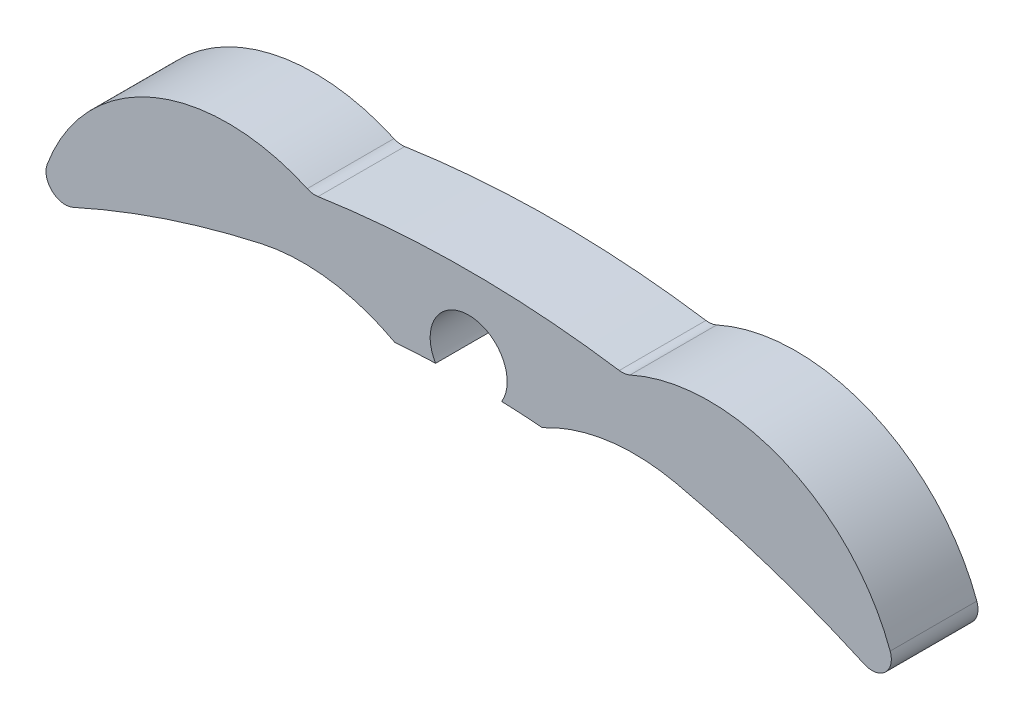
ISO-10303-21;
HEADER;
FILE_DESCRIPTION(('STEP AP214'),'2;1');
FILE_NAME('part.step','',(''),(''),'','','');
FILE_SCHEMA(('AUTOMOTIVE_DESIGN { 1 0 10303 214 1 1 1 1 }'));
ENDSEC;
DATA;
#1=APPLICATION_CONTEXT('core data for automotive mechanical design processes');
#2=APPLICATION_PROTOCOL_DEFINITION('international standard','automotive_design',2000,#1);
#3=PRODUCT_CONTEXT('',#1,'mechanical');
#4=PRODUCT('Part','Part','',(#3));
#5=PRODUCT_RELATED_PRODUCT_CATEGORY('part','',(#4));
#6=PRODUCT_DEFINITION_FORMATION('','',#4);
#7=PRODUCT_DEFINITION_CONTEXT('part definition',#1,'design');
#8=PRODUCT_DEFINITION('design','',#6,#7);
#9=PRODUCT_DEFINITION_SHAPE('','',#8);
#10=(LENGTH_UNIT() NAMED_UNIT(*) SI_UNIT(.MILLI.,.METRE.));
#11=(NAMED_UNIT(*) PLANE_ANGLE_UNIT() SI_UNIT($,.RADIAN.));
#12=(NAMED_UNIT(*) SI_UNIT($,.STERADIAN.) SOLID_ANGLE_UNIT());
#13=UNCERTAINTY_MEASURE_WITH_UNIT(LENGTH_MEASURE(1.E-05),#10,'distance_accuracy_value','');
#14=(GEOMETRIC_REPRESENTATION_CONTEXT(3) GLOBAL_UNCERTAINTY_ASSIGNED_CONTEXT((#13)) GLOBAL_UNIT_ASSIGNED_CONTEXT((#10,
#11,#12)) REPRESENTATION_CONTEXT('',''));
#15=CARTESIAN_POINT('',(0.,0.,0.));
#16=DIRECTION('',(0.,0.,1.));
#17=DIRECTION('',(1.,0.,0.));
#18=AXIS2_PLACEMENT_3D('',#15,#16,#17);
#19=CARTESIAN_POINT('',(0.,-48.845,4.5));
#20=DIRECTION('',(0.,0.,-1.));
#21=DIRECTION('',(-1.,0.,0.));
#22=AXIS2_PLACEMENT_3D('',#19,#20,#21);
#23=CYLINDRICAL_SURFACE('',#22,47.8476983184575);
#24=CARTESIAN_POINT('',(0.,-48.845,0.));
#25=DIRECTION('',(0.,0.,-1.));
#26=DIRECTION('',(1.,0.,0.));
#27=AXIS2_PLACEMENT_3D('',#24,#25,#26);
#28=CIRCLE('',#27,47.8476983184575);
#29=CARTESIAN_POINT('',(1.7155406767965,-1.02806623631773,0.));
#30=VERTEX_POINT('',#29);
#31=CARTESIAN_POINT('',(3.83085114312133,-1.15090378366136,0.));
#32=VERTEX_POINT('',#31);
#33=EDGE_CURVE('E153',#30,#32,#28,.T.);
#34=ORIENTED_EDGE('',*,*,#33,.T.);
#35=DIRECTION('',(0.,0.,1.));
#36=VECTOR('',#35,1.);
#37=CARTESIAN_POINT('',(3.83085114312133,-1.15090378366136,2.25));
#38=LINE('',#37,#36);
#39=CARTESIAN_POINT('',(3.83085114312133,-1.15090378366136,4.5));
#40=VERTEX_POINT('',#39);
#41=EDGE_CURVE('E140',#32,#40,#38,.T.);
#42=ORIENTED_EDGE('',*,*,#41,.T.);
#43=CARTESIAN_POINT('',(0.,-48.845,4.5));
#44=DIRECTION('',(0.,0.,-1.));
#45=DIRECTION('',(1.,0.,0.));
#46=AXIS2_PLACEMENT_3D('',#43,#44,#45);
#47=CIRCLE('',#46,47.8476983184575);
#48=CARTESIAN_POINT('',(1.7155406767965,-1.02806623631773,4.5));
#49=VERTEX_POINT('',#48);
#50=EDGE_CURVE('E151',#49,#40,#47,.T.);
#51=ORIENTED_EDGE('',*,*,#50,.F.);
#52=DIRECTION('',(0.,0.,-1.));
#53=VECTOR('',#52,1.);
#54=CARTESIAN_POINT('',(1.7155406767965,-1.02806623631773,4.5));
#55=LINE('',#54,#53);
#56=EDGE_CURVE('E177',#49,#30,#55,.T.);
#57=ORIENTED_EDGE('',*,*,#56,.T.);
#58=EDGE_LOOP('',(#34,#42,#51,#57));
#59=FACE_BOUND('',#58,.T.);
#60=ADVANCED_FACE('F33',(#59),#23,.F.);
#61=CARTESIAN_POINT('',(12.5,-5.61595883552355,4.5));
#62=DIRECTION('',(0.,0.,-1.));
#63=DIRECTION('',(-1.,0.,0.));
#64=AXIS2_PLACEMENT_3D('',#61,#62,#63);
#65=CYLINDRICAL_SURFACE('',#64,10.);
#66=CARTESIAN_POINT('',(12.5,-5.61595883552355,0.));
#67=DIRECTION('',(0.,0.,1.));
#68=DIRECTION('',(1.,0.,0.));
#69=AXIS2_PLACEMENT_3D('',#66,#67,#68);
#70=CIRCLE('',#69,10.);
#71=CARTESIAN_POINT('',(21.8868168597631,-2.16810889080908,0.));
#72=VERTEX_POINT('',#71);
#73=CARTESIAN_POINT('',(8.38018067722006,3.49596131050765,0.));
#74=VERTEX_POINT('',#73);
#75=EDGE_CURVE('E179',#72,#74,#70,.T.);
#76=ORIENTED_EDGE('',*,*,#75,.T.);
#77=DIRECTION('',(0.,0.,-1.));
#78=VECTOR('',#77,1.);
#79=CARTESIAN_POINT('',(8.38018067722006,3.49596131050765,4.5));
#80=LINE('',#79,#78);
#81=CARTESIAN_POINT('',(8.38018067722006,3.49596131050765,4.5));
#82=VERTEX_POINT('',#81);
#83=EDGE_CURVE('E211',#74,#82,#80,.F.);
#84=ORIENTED_EDGE('',*,*,#83,.T.);
#85=CARTESIAN_POINT('',(12.5,-5.61595883552355,4.5));
#86=DIRECTION('',(0.,0.,1.));
#87=DIRECTION('',(1.,0.,0.));
#88=AXIS2_PLACEMENT_3D('',#85,#86,#87);
#89=CIRCLE('',#88,10.);
#90=CARTESIAN_POINT('',(21.8868168597631,-2.16810889080908,4.5));
#91=VERTEX_POINT('',#90);
#92=EDGE_CURVE('E160',#91,#82,#89,.T.);
#93=ORIENTED_EDGE('',*,*,#92,.F.);
#94=DIRECTION('',(0.,0.,-1.));
#95=VECTOR('',#94,1.);
#96=CARTESIAN_POINT('',(21.8868168597631,-2.16810889080908,4.5));
#97=LINE('',#96,#95);
#98=EDGE_CURVE('E208',#91,#72,#97,.T.);
#99=ORIENTED_EDGE('',*,*,#98,.T.);
#100=EDGE_LOOP('',(#76,#84,#93,#99));
#101=FACE_BOUND('',#100,.T.);
#102=ADVANCED_FACE('F272',(#101),#65,.T.);
#103=CARTESIAN_POINT('',(0.,-48.845,4.5));
#104=DIRECTION('',(0.,0.,-1.));
#105=DIRECTION('',(-1.,0.,0.));
#106=AXIS2_PLACEMENT_3D('',#103,#104,#105);
#107=CYLINDRICAL_SURFACE('',#106,52.845);
#108=CARTESIAN_POINT('',(0.,-48.845,4.5));
#109=DIRECTION('',(0.,0.,1.));
#110=DIRECTION('',(1.,0.,0.));
#111=AXIS2_PLACEMENT_3D('',#108,#109,#110);
#112=CIRCLE('',#111,52.845);
#113=CARTESIAN_POINT('',(7.82021474002161,3.4181635707211,4.5));
#114=VERTEX_POINT('',#113);
#115=CARTESIAN_POINT('',(-7.82021474002159,3.4181635707211,4.5));
#116=VERTEX_POINT('',#115);
#117=EDGE_CURVE('E164',#114,#116,#112,.T.);
#118=ORIENTED_EDGE('',*,*,#117,.F.);
#119=DIRECTION('',(0.,0.,-1.));
#120=VECTOR('',#119,1.);
#121=CARTESIAN_POINT('',(7.82021474002162,3.41816357072111,4.5));
#122=LINE('',#121,#120);
#123=CARTESIAN_POINT('',(7.82021474002161,3.4181635707211,0.));
#124=VERTEX_POINT('',#123);
#125=EDGE_CURVE('E205',#114,#124,#122,.T.);
#126=ORIENTED_EDGE('',*,*,#125,.T.);
#127=CARTESIAN_POINT('',(0.,-48.845,0.));
#128=DIRECTION('',(0.,0.,1.));
#129=DIRECTION('',(1.,0.,0.));
#130=AXIS2_PLACEMENT_3D('',#127,#128,#129);
#131=CIRCLE('',#130,52.845);
#132=CARTESIAN_POINT('',(-7.82021474002159,3.4181635707211,0.));
#133=VERTEX_POINT('',#132);
#134=EDGE_CURVE('E182',#124,#133,#131,.T.);
#135=ORIENTED_EDGE('',*,*,#134,.T.);
#136=DIRECTION('',(0.,0.,-1.));
#137=VECTOR('',#136,1.);
#138=CARTESIAN_POINT('',(-7.82021474002159,3.41816357072111,4.5));
#139=LINE('',#138,#137);
#140=EDGE_CURVE('E203',#133,#116,#139,.F.);
#141=ORIENTED_EDGE('',*,*,#140,.T.);
#142=EDGE_LOOP('',(#118,#126,#135,#141));
#143=FACE_BOUND('',#142,.T.);
#144=ADVANCED_FACE('F242',(#143),#107,.T.);
#145=CARTESIAN_POINT('',(-12.5,-5.61595883552354,4.5));
#146=DIRECTION('',(0.,0.,-1.));
#147=DIRECTION('',(-1.,0.,0.));
#148=AXIS2_PLACEMENT_3D('',#145,#146,#147);
#149=CYLINDRICAL_SURFACE('',#148,10.);
#150=CARTESIAN_POINT('',(-12.5,-5.61595883552354,4.5));
#151=DIRECTION('',(0.,0.,1.));
#152=DIRECTION('',(1.,0.,0.));
#153=AXIS2_PLACEMENT_3D('',#150,#151,#152);
#154=CIRCLE('',#153,10.);
#155=CARTESIAN_POINT('',(-8.38018067722004,3.49596131050764,4.5));
#156=VERTEX_POINT('',#155);
#157=CARTESIAN_POINT('',(-21.8868168597631,-2.16810889080908,4.5));
#158=VERTEX_POINT('',#157);
#159=EDGE_CURVE('E172',#156,#158,#154,.T.);
#160=ORIENTED_EDGE('',*,*,#159,.F.);
#161=DIRECTION('',(0.,0.,-1.));
#162=VECTOR('',#161,1.);
#163=CARTESIAN_POINT('',(-8.38018067722004,3.49596131050764,4.5));
#164=LINE('',#163,#162);
#165=CARTESIAN_POINT('',(-8.38018067722004,3.49596131050764,0.));
#166=VERTEX_POINT('',#165);
#167=EDGE_CURVE('E216',#156,#166,#164,.T.);
#168=ORIENTED_EDGE('',*,*,#167,.T.);
#169=CARTESIAN_POINT('',(-12.5,-5.61595883552354,0.));
#170=DIRECTION('',(0.,0.,1.));
#171=DIRECTION('',(1.,0.,0.));
#172=AXIS2_PLACEMENT_3D('',#169,#170,#171);
#173=CIRCLE('',#172,10.);
#174=CARTESIAN_POINT('',(-21.8868168597631,-2.16810889080908,0.));
#175=VERTEX_POINT('',#174);
#176=EDGE_CURVE('E185',#166,#175,#173,.T.);
#177=ORIENTED_EDGE('',*,*,#176,.T.);
#178=DIRECTION('',(0.,0.,-1.));
#179=VECTOR('',#178,1.);
#180=CARTESIAN_POINT('',(-21.8868168597631,-2.16810889080908,4.5));
#181=LINE('',#180,#179);
#182=EDGE_CURVE('E213',#175,#158,#181,.F.);
#183=ORIENTED_EDGE('',*,*,#182,.T.);
#184=EDGE_LOOP('',(#160,#168,#177,#183));
#185=FACE_BOUND('',#184,.T.);
#186=ADVANCED_FACE('F248',(#185),#149,.T.);
#187=CARTESIAN_POINT('',(0.,-48.845,4.5));
#188=DIRECTION('',(0.,0.,-1.));
#189=DIRECTION('',(-1.,0.,0.));
#190=AXIS2_PLACEMENT_3D('',#187,#188,#189);
#191=CYLINDRICAL_SURFACE('',#190,47.8476983184575);
#192=CARTESIAN_POINT('',(0.,-48.845,4.5));
#193=DIRECTION('',(0.,0.,-1.));
#194=DIRECTION('',(1.,0.,0.));
#195=AXIS2_PLACEMENT_3D('',#192,#193,#194);
#196=CIRCLE('',#195,47.8476983184575);
#197=CARTESIAN_POINT('',(-3.83085114312133,-1.15090378366136,4.5));
#198=VERTEX_POINT('',#197);
#199=CARTESIAN_POINT('',(-1.71554067679652,-1.0280662363177,4.5));
#200=VERTEX_POINT('',#199);
#201=EDGE_CURVE('E174',#198,#200,#196,.T.);
#202=ORIENTED_EDGE('',*,*,#201,.F.);
#203=DIRECTION('',(0.,0.,1.));
#204=VECTOR('',#203,1.);
#205=CARTESIAN_POINT('',(-3.83085114312133,-1.15090378366136,2.25));
#206=LINE('',#205,#204);
#207=CARTESIAN_POINT('',(-3.83085114312133,-1.15090378366136,0.));
#208=VERTEX_POINT('',#207);
#209=EDGE_CURVE('E154',#198,#208,#206,.F.);
#210=ORIENTED_EDGE('',*,*,#209,.T.);
#211=CARTESIAN_POINT('',(0.,-48.845,0.));
#212=DIRECTION('',(0.,0.,-1.));
#213=DIRECTION('',(1.,0.,0.));
#214=AXIS2_PLACEMENT_3D('',#211,#212,#213);
#215=CIRCLE('',#214,47.8476983184575);
#216=CARTESIAN_POINT('',(-1.71554067679652,-1.0280662363177,0.));
#217=VERTEX_POINT('',#216);
#218=EDGE_CURVE('E166',#208,#217,#215,.T.);
#219=ORIENTED_EDGE('',*,*,#218,.T.);
#220=DIRECTION('',(0.,0.,-1.));
#221=VECTOR('',#220,1.);
#222=CARTESIAN_POINT('',(-1.71554067679652,-1.0280662363177,4.5));
#223=LINE('',#222,#221);
#224=EDGE_CURVE('E190',#200,#217,#223,.T.);
#225=ORIENTED_EDGE('',*,*,#224,.F.);
#226=EDGE_LOOP('',(#202,#210,#219,#225));
#227=FACE_BOUND('',#226,.T.);
#228=ADVANCED_FACE('F311',(#227),#191,.F.);
#229=CARTESIAN_POINT('',(0.,0.,4.5));
#230=DIRECTION('',(0.,0.,-1.));
#231=DIRECTION('',(-1.,0.,0.));
#232=AXIS2_PLACEMENT_3D('',#229,#230,#231);
#233=CYLINDRICAL_SURFACE('',#232,1.99999999999998);
#234=CARTESIAN_POINT('',(0.,0.,0.));
#235=DIRECTION('',(0.,0.,-1.));
#236=DIRECTION('',(1.,0.,0.));
#237=AXIS2_PLACEMENT_3D('',#234,#235,#236);
#238=CIRCLE('',#237,1.99999999999998);
#239=EDGE_CURVE('E161',#217,#30,#238,.T.);
#240=ORIENTED_EDGE('',*,*,#239,.T.);
#241=ORIENTED_EDGE('',*,*,#56,.F.);
#242=CARTESIAN_POINT('',(0.,0.,4.5));
#243=DIRECTION('',(0.,0.,-1.));
#244=DIRECTION('',(1.,0.,0.));
#245=AXIS2_PLACEMENT_3D('',#242,#243,#244);
#246=CIRCLE('',#245,1.99999999999998);
#247=EDGE_CURVE('E158',#200,#49,#246,.T.);
#248=ORIENTED_EDGE('',*,*,#247,.F.);
#249=ORIENTED_EDGE('',*,*,#224,.T.);
#250=EDGE_LOOP('',(#240,#241,#248,#249));
#251=FACE_BOUND('',#250,.T.);
#252=ADVANCED_FACE('F306',(#251),#233,.F.);
#253=CARTESIAN_POINT('',(0.,-24.4225,4.5));
#254=DIRECTION('',(0.,0.,1.));
#255=DIRECTION('',(1.,0.,0.));
#256=AXIS2_PLACEMENT_3D('',#253,#254,#255);
#257=PLANE('',#256);
#258=CARTESIAN_POINT('',(0.,-48.845,4.5));
#259=DIRECTION('',(0.,0.,1.));
#260=DIRECTION('',(1.,0.,0.));
#261=AXIS2_PLACEMENT_3D('',#258,#259,#260);
#262=CIRCLE('',#261,49.8476983184575);
#263=CARTESIAN_POINT('',(20.5361571321734,-3.42408765897984,4.5));
#264=VERTEX_POINT('',#263);
#265=CARTESIAN_POINT('',(10.7647620593984,-0.17352041028041,4.5));
#266=VERTEX_POINT('',#265);
#267=EDGE_CURVE('E263',#264,#266,#262,.T.);
#268=ORIENTED_EDGE('',*,*,#267,.F.);
#269=CARTESIAN_POINT('',(20.9481351737868,-2.51289388528053,4.5));
#270=DIRECTION('',(0.,0.,1.));
#271=DIRECTION('',(1.,0.,0.));
#272=AXIS2_PLACEMENT_3D('',#269,#270,#271);
#273=CIRCLE('',#272,1.);
#274=EDGE_CURVE('E225',#264,#91,#273,.T.);
#275=ORIENTED_EDGE('',*,*,#274,.T.);
#276=ORIENTED_EDGE('',*,*,#92,.T.);
#277=CARTESIAN_POINT('',(7.96819874494207,4.40715332511075,4.5));
#278=DIRECTION('',(0.,0.,1.));
#279=DIRECTION('',(1.,0.,0.));
#280=AXIS2_PLACEMENT_3D('',#277,#278,#279);
#281=CIRCLE('',#280,1.);
#282=EDGE_CURVE('E231',#82,#114,#281,.F.);
#283=ORIENTED_EDGE('',*,*,#282,.T.);
#284=ORIENTED_EDGE('',*,*,#117,.T.);
#285=CARTESIAN_POINT('',(-7.96819874494205,4.40715332511076,4.5));
#286=DIRECTION('',(0.,0.,1.));
#287=DIRECTION('',(1.,0.,0.));
#288=AXIS2_PLACEMENT_3D('',#285,#286,#287);
#289=CIRCLE('',#288,1.);
#290=EDGE_CURVE('E11',#116,#156,#289,.F.);
#291=ORIENTED_EDGE('',*,*,#290,.T.);
#292=ORIENTED_EDGE('',*,*,#159,.T.);
#293=CARTESIAN_POINT('',(-20.9481351737868,-2.51289388528052,4.5));
#294=DIRECTION('',(0.,0.,1.));
#295=DIRECTION('',(1.,0.,0.));
#296=AXIS2_PLACEMENT_3D('',#293,#294,#295);
#297=CIRCLE('',#296,1.);
#298=CARTESIAN_POINT('',(-20.5361571321734,-3.42408765897984,4.5));
#299=VERTEX_POINT('',#298);
#300=EDGE_CURVE('E48',#158,#299,#297,.T.);
#301=ORIENTED_EDGE('',*,*,#300,.T.);
#302=CARTESIAN_POINT('',(-10.7647620593984,-0.17352041028041,4.5));
#303=VERTEX_POINT('',#302);
#304=EDGE_CURVE('E259',#303,#299,#262,.T.);
#305=ORIENTED_EDGE('',*,*,#304,.F.);
#306=CARTESIAN_POINT('',(-8.60523164525037,-9.93755791483608,4.5));
#307=DIRECTION('',(0.,0.,1.));
#308=DIRECTION('',(1.,0.,0.));
#309=AXIS2_PLACEMENT_3D('',#306,#307,#308);
#310=CIRCLE('',#309,10.);
#311=EDGE_CURVE('E199',#303,#198,#310,.F.);
#312=ORIENTED_EDGE('',*,*,#311,.T.);
#313=ORIENTED_EDGE('',*,*,#201,.T.);
#314=ORIENTED_EDGE('',*,*,#247,.T.);
#315=ORIENTED_EDGE('',*,*,#50,.T.);
#316=CARTESIAN_POINT('',(8.60523164525038,-9.93755791483608,4.5));
#317=DIRECTION('',(0.,0.,1.));
#318=DIRECTION('',(1.,0.,0.));
#319=AXIS2_PLACEMENT_3D('',#316,#317,#318);
#320=CIRCLE('',#319,10.);
#321=EDGE_CURVE('E136',#40,#266,#320,.F.);
#322=ORIENTED_EDGE('',*,*,#321,.T.);
#323=EDGE_LOOP('',(#268,#275,#276,#283,#284,#291,#292,#301,#305,#312,#313,#314,#315,#322));
#324=FACE_BOUND('',#323,.T.);
#325=ADVANCED_FACE('F156',(#324),#257,.T.);
#326=CARTESIAN_POINT('',(0.,-24.4225,0.));
#327=DIRECTION('',(0.,0.,1.));
#328=DIRECTION('',(1.,0.,0.));
#329=AXIS2_PLACEMENT_3D('',#326,#327,#328);
#330=PLANE('',#329);
#331=ORIENTED_EDGE('',*,*,#75,.F.);
#332=CARTESIAN_POINT('',(20.9481351737868,-2.51289388528053,0.));
#333=DIRECTION('',(0.,0.,1.));
#334=DIRECTION('',(1.,0.,0.));
#335=AXIS2_PLACEMENT_3D('',#332,#333,#334);
#336=CIRCLE('',#335,1.);
#337=CARTESIAN_POINT('',(20.5361571321734,-3.42408765897984,0.));
#338=VERTEX_POINT('',#337);
#339=EDGE_CURVE('E221',#72,#338,#336,.F.);
#340=ORIENTED_EDGE('',*,*,#339,.T.);
#341=CARTESIAN_POINT('',(0.,-48.845,0.));
#342=DIRECTION('',(0.,0.,1.));
#343=DIRECTION('',(1.,0.,0.));
#344=AXIS2_PLACEMENT_3D('',#341,#342,#343);
#345=CIRCLE('',#344,49.8476983184575);
#346=CARTESIAN_POINT('',(10.7647620593984,-0.17352041028041,0.));
#347=VERTEX_POINT('',#346);
#348=EDGE_CURVE('E193',#338,#347,#345,.T.);
#349=ORIENTED_EDGE('',*,*,#348,.T.);
#350=CARTESIAN_POINT('',(8.60523164525038,-9.93755791483608,0.));
#351=DIRECTION('',(0.,0.,1.));
#352=DIRECTION('',(1.,0.,0.));
#353=AXIS2_PLACEMENT_3D('',#350,#351,#352);
#354=CIRCLE('',#353,10.);
#355=EDGE_CURVE('E144',#347,#32,#354,.T.);
#356=ORIENTED_EDGE('',*,*,#355,.T.);
#357=ORIENTED_EDGE('',*,*,#33,.F.);
#358=ORIENTED_EDGE('',*,*,#239,.F.);
#359=ORIENTED_EDGE('',*,*,#218,.F.);
#360=CARTESIAN_POINT('',(-8.60523164525037,-9.93755791483608,0.));
#361=DIRECTION('',(0.,0.,1.));
#362=DIRECTION('',(1.,0.,0.));
#363=AXIS2_PLACEMENT_3D('',#360,#361,#362);
#364=CIRCLE('',#363,10.);
#365=CARTESIAN_POINT('',(-10.7647620593984,-0.17352041028041,0.));
#366=VERTEX_POINT('',#365);
#367=EDGE_CURVE('E201',#208,#366,#364,.T.);
#368=ORIENTED_EDGE('',*,*,#367,.T.);
#369=CARTESIAN_POINT('',(0.,-48.845,0.));
#370=DIRECTION('',(0.,0.,1.));
#371=DIRECTION('',(1.,0.,0.));
#372=AXIS2_PLACEMENT_3D('',#369,#370,#371);
#373=CIRCLE('',#372,49.8476983184575);
#374=CARTESIAN_POINT('',(-20.5361571321734,-3.42408765897984,0.));
#375=VERTEX_POINT('',#374);
#376=EDGE_CURVE('E257',#366,#375,#373,.T.);
#377=ORIENTED_EDGE('',*,*,#376,.T.);
#378=CARTESIAN_POINT('',(-20.9481351737868,-2.51289388528052,0.));
#379=DIRECTION('',(0.,0.,1.));
#380=DIRECTION('',(1.,0.,0.));
#381=AXIS2_PLACEMENT_3D('',#378,#379,#380);
#382=CIRCLE('',#381,1.);
#383=EDGE_CURVE('E219',#375,#175,#382,.F.);
#384=ORIENTED_EDGE('',*,*,#383,.T.);
#385=ORIENTED_EDGE('',*,*,#176,.F.);
#386=CARTESIAN_POINT('',(-7.96819874494205,4.40715332511076,0.));
#387=DIRECTION('',(0.,0.,1.));
#388=DIRECTION('',(1.,0.,0.));
#389=AXIS2_PLACEMENT_3D('',#386,#387,#388);
#390=CIRCLE('',#389,1.);
#391=EDGE_CURVE('E41',#166,#133,#390,.T.);
#392=ORIENTED_EDGE('',*,*,#391,.T.);
#393=ORIENTED_EDGE('',*,*,#134,.F.);
#394=CARTESIAN_POINT('',(7.96819874494207,4.40715332511075,0.));
#395=DIRECTION('',(0.,0.,1.));
#396=DIRECTION('',(1.,0.,0.));
#397=AXIS2_PLACEMENT_3D('',#394,#395,#396);
#398=CIRCLE('',#397,1.);
#399=EDGE_CURVE('E229',#124,#74,#398,.T.);
#400=ORIENTED_EDGE('',*,*,#399,.T.);
#401=EDGE_LOOP('',(#331,#340,#349,#356,#357,#358,#359,#368,#377,#384,#385,#392,#393,#400));
#402=FACE_BOUND('',#401,.T.);
#403=ADVANCED_FACE('F236',(#402),#330,.F.);
#404=CARTESIAN_POINT('',(0.,-48.845,0.));
#405=DIRECTION('',(0.,0.,1.));
#406=DIRECTION('',(1.,0.,0.));
#407=AXIS2_PLACEMENT_3D('',#404,#405,#406);
#408=CYLINDRICAL_SURFACE('',#407,49.8476983184575);
#409=ORIENTED_EDGE('',*,*,#304,.T.);
#410=DIRECTION('',(0.,0.,1.));
#411=VECTOR('',#410,1.);
#412=CARTESIAN_POINT('',(-20.5361571321734,-3.42408765897984,0.));
#413=LINE('',#412,#411);
#414=EDGE_CURVE('E227',#299,#375,#413,.F.);
#415=ORIENTED_EDGE('',*,*,#414,.T.);
#416=ORIENTED_EDGE('',*,*,#376,.F.);
#417=DIRECTION('',(0.,0.,1.));
#418=VECTOR('',#417,1.);
#419=CARTESIAN_POINT('',(-10.7647620593984,-0.17352041028041,0.));
#420=LINE('',#419,#418);
#421=EDGE_CURVE('E145',#366,#303,#420,.T.);
#422=ORIENTED_EDGE('',*,*,#421,.T.);
#423=EDGE_LOOP('',(#409,#415,#416,#422));
#424=FACE_BOUND('',#423,.T.);
#425=ADVANCED_FACE('F256',(#424),#408,.F.);
#426=ORIENTED_EDGE('',*,*,#348,.F.);
#427=DIRECTION('',(0.,0.,1.));
#428=VECTOR('',#427,1.);
#429=CARTESIAN_POINT('',(20.5361571321734,-3.42408765897983,0.));
#430=LINE('',#429,#428);
#431=EDGE_CURVE('E56',#338,#264,#430,.T.);
#432=ORIENTED_EDGE('',*,*,#431,.T.);
#433=ORIENTED_EDGE('',*,*,#267,.T.);
#434=DIRECTION('',(0.,0.,1.));
#435=VECTOR('',#434,1.);
#436=CARTESIAN_POINT('',(10.7647620593984,-0.17352041028041,0.));
#437=LINE('',#436,#435);
#438=EDGE_CURVE('E142',#266,#347,#437,.F.);
#439=ORIENTED_EDGE('',*,*,#438,.T.);
#440=EDGE_LOOP('',(#426,#432,#433,#439));
#441=FACE_BOUND('',#440,.T.);
#442=ADVANCED_FACE('F265',(#441),#408,.F.);
#443=CARTESIAN_POINT('',(8.60523164525038,-9.93755791483608,0.));
#444=DIRECTION('',(0.,0.,1.));
#445=DIRECTION('',(1.,0.,0.));
#446=AXIS2_PLACEMENT_3D('',#443,#444,#445);
#447=CYLINDRICAL_SURFACE('',#446,10.);
#448=ORIENTED_EDGE('',*,*,#355,.F.);
#449=ORIENTED_EDGE('',*,*,#438,.F.);
#450=ORIENTED_EDGE('',*,*,#321,.F.);
#451=ORIENTED_EDGE('',*,*,#41,.F.);
#452=EDGE_LOOP('',(#448,#449,#450,#451));
#453=FACE_BOUND('',#452,.T.);
#454=ADVANCED_FACE('F139',(#453),#447,.F.);
#455=CARTESIAN_POINT('',(-8.60523164525037,-9.93755791483608,4.5));
#456=DIRECTION('',(0.,0.,1.));
#457=DIRECTION('',(1.,0.,0.));
#458=AXIS2_PLACEMENT_3D('',#455,#456,#457);
#459=CYLINDRICAL_SURFACE('',#458,10.);
#460=ORIENTED_EDGE('',*,*,#367,.F.);
#461=ORIENTED_EDGE('',*,*,#209,.F.);
#462=ORIENTED_EDGE('',*,*,#311,.F.);
#463=ORIENTED_EDGE('',*,*,#421,.F.);
#464=EDGE_LOOP('',(#460,#461,#462,#463));
#465=FACE_BOUND('',#464,.T.);
#466=ADVANCED_FACE('F278',(#465),#459,.F.);
#467=CARTESIAN_POINT('',(7.96819874494207,4.40715332511075,4.5));
#468=DIRECTION('',(0.,0.,1.));
#469=DIRECTION('',(1.,0.,0.));
#470=AXIS2_PLACEMENT_3D('',#467,#468,#469);
#471=CYLINDRICAL_SURFACE('',#470,1.);
#472=ORIENTED_EDGE('',*,*,#282,.F.);
#473=ORIENTED_EDGE('',*,*,#83,.F.);
#474=ORIENTED_EDGE('',*,*,#399,.F.);
#475=ORIENTED_EDGE('',*,*,#125,.F.);
#476=EDGE_LOOP('',(#472,#473,#474,#475));
#477=FACE_BOUND('',#476,.T.);
#478=ADVANCED_FACE('F276',(#477),#471,.F.);
#479=CARTESIAN_POINT('',(-7.96819874494205,4.40715332511076,4.5));
#480=DIRECTION('',(0.,0.,1.));
#481=DIRECTION('',(1.,0.,0.));
#482=AXIS2_PLACEMENT_3D('',#479,#480,#481);
#483=CYLINDRICAL_SURFACE('',#482,1.);
#484=ORIENTED_EDGE('',*,*,#290,.F.);
#485=ORIENTED_EDGE('',*,*,#140,.F.);
#486=ORIENTED_EDGE('',*,*,#391,.F.);
#487=ORIENTED_EDGE('',*,*,#167,.F.);
#488=EDGE_LOOP('',(#484,#485,#486,#487));
#489=FACE_BOUND('',#488,.T.);
#490=ADVANCED_FACE('F245',(#489),#483,.F.);
#491=CARTESIAN_POINT('',(20.9481351737868,-2.51289388528053,0.));
#492=DIRECTION('',(0.,0.,1.));
#493=DIRECTION('',(1.,0.,0.));
#494=AXIS2_PLACEMENT_3D('',#491,#492,#493);
#495=CYLINDRICAL_SURFACE('',#494,1.);
#496=ORIENTED_EDGE('',*,*,#274,.F.);
#497=ORIENTED_EDGE('',*,*,#431,.F.);
#498=ORIENTED_EDGE('',*,*,#339,.F.);
#499=ORIENTED_EDGE('',*,*,#98,.F.);
#500=EDGE_LOOP('',(#496,#497,#498,#499));
#501=FACE_BOUND('',#500,.T.);
#502=ADVANCED_FACE('F270',(#501),#495,.T.);
#503=CARTESIAN_POINT('',(-20.9481351737868,-2.51289388528052,0.));
#504=DIRECTION('',(0.,0.,-1.));
#505=DIRECTION('',(-1.,0.,0.));
#506=AXIS2_PLACEMENT_3D('',#503,#504,#505);
#507=CYLINDRICAL_SURFACE('',#506,1.);
#508=ORIENTED_EDGE('',*,*,#383,.F.);
#509=ORIENTED_EDGE('',*,*,#414,.F.);
#510=ORIENTED_EDGE('',*,*,#300,.F.);
#511=ORIENTED_EDGE('',*,*,#182,.F.);
#512=EDGE_LOOP('',(#508,#509,#510,#511));
#513=FACE_BOUND('',#512,.T.);
#514=ADVANCED_FACE('F35',(#513),#507,.T.);
#515=CLOSED_SHELL('',(#60,#102,#144,#186,#228,#252,#325,#403,#425,#442,#454,#466,#478,#490,#502,#514));
#516=MANIFOLD_SOLID_BREP('B2',#515);
#517=ADVANCED_BREP_SHAPE_REPRESENTATION('',(#18,#516),#14);
#518=SHAPE_DEFINITION_REPRESENTATION(#9,#517);
ENDSEC;
END-ISO-10303-21;
